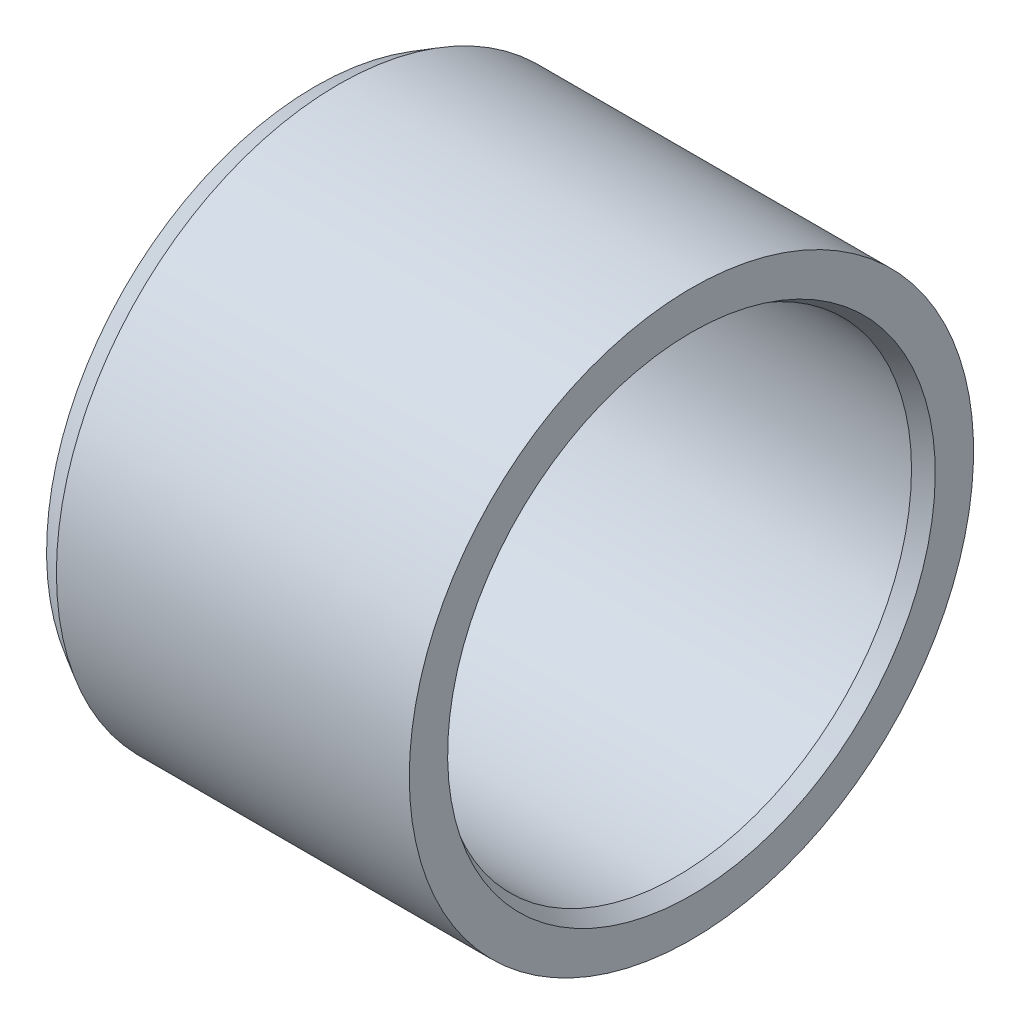
ISO-10303-21;
HEADER;
FILE_DESCRIPTION(('STEP AP214'),'2;1');
FILE_NAME('part.step','',(''),(''),'','','');
FILE_SCHEMA(('AUTOMOTIVE_DESIGN { 1 0 10303 214 1 1 1 1 }'));
ENDSEC;
DATA;
#1=APPLICATION_CONTEXT('core data for automotive mechanical design processes');
#2=APPLICATION_PROTOCOL_DEFINITION('international standard','automotive_design',2000,#1);
#3=PRODUCT_CONTEXT('',#1,'mechanical');
#4=PRODUCT('Part','Part','',(#3));
#5=PRODUCT_RELATED_PRODUCT_CATEGORY('part','',(#4));
#6=PRODUCT_DEFINITION_FORMATION('','',#4);
#7=PRODUCT_DEFINITION_CONTEXT('part definition',#1,'design');
#8=PRODUCT_DEFINITION('design','',#6,#7);
#9=PRODUCT_DEFINITION_SHAPE('','',#8);
#10=(LENGTH_UNIT() NAMED_UNIT(*) SI_UNIT(.MILLI.,.METRE.));
#11=(NAMED_UNIT(*) PLANE_ANGLE_UNIT() SI_UNIT($,.RADIAN.));
#12=(NAMED_UNIT(*) SI_UNIT($,.STERADIAN.) SOLID_ANGLE_UNIT());
#13=UNCERTAINTY_MEASURE_WITH_UNIT(LENGTH_MEASURE(1.E-05),#10,'distance_accuracy_value','');
#14=(GEOMETRIC_REPRESENTATION_CONTEXT(3) GLOBAL_UNCERTAINTY_ASSIGNED_CONTEXT((#13)) GLOBAL_UNIT_ASSIGNED_CONTEXT((#10,
#11,#12)) REPRESENTATION_CONTEXT('',''));
#15=CARTESIAN_POINT('',(0.,0.,0.));
#16=DIRECTION('',(0.,0.,1.));
#17=DIRECTION('',(1.,0.,0.));
#18=AXIS2_PLACEMENT_3D('',#15,#16,#17);
#19=CARTESIAN_POINT('',(12.7,0.,0.));
#20=DIRECTION('',(-1.,0.,0.));
#21=DIRECTION('',(0.,0.,1.));
#22=AXIS2_PLACEMENT_3D('',#19,#20,#21);
#23=CYLINDRICAL_SURFACE('',#22,7.9375);
#24=CARTESIAN_POINT('',(0.,0.,0.));
#25=DIRECTION('',(-1.,0.,0.));
#26=DIRECTION('',(0.,0.,1.));
#27=AXIS2_PLACEMENT_3D('',#24,#25,#26);
#28=CIRCLE('',#27,7.9375);
#29=CARTESIAN_POINT('',(0.,0.,7.93750000000001));
#30=VERTEX_POINT('',#29);
#31=EDGE_CURVE('E17',#30,#30,#28,.F.);
#32=ORIENTED_EDGE('',*,*,#31,.F.);
#33=EDGE_LOOP('',(#32));
#34=FACE_BOUND('',#33,.T.);
#35=CARTESIAN_POINT('',(12.192,0.,0.));
#36=DIRECTION('',(1.,0.,0.));
#37=DIRECTION('',(0.,0.,-1.));
#38=AXIS2_PLACEMENT_3D('',#35,#36,#37);
#39=CIRCLE('',#38,7.9375);
#40=CARTESIAN_POINT('',(12.192,0.,-7.93750000000001));
#41=VERTEX_POINT('',#40);
#42=EDGE_CURVE('E35',#41,#41,#39,.T.);
#43=ORIENTED_EDGE('',*,*,#42,.T.);
#44=EDGE_LOOP('',(#43));
#45=FACE_BOUND('',#44,.T.);
#46=ADVANCED_FACE('F14',(#34,#45),#23,.F.);
#47=CARTESIAN_POINT('',(0.,9.07039439804018,0.));
#48=DIRECTION('',(-1.,0.,0.));
#49=DIRECTION('',(0.,0.,1.));
#50=AXIS2_PLACEMENT_3D('',#47,#48,#49);
#51=PLANE('',#50);
#52=CARTESIAN_POINT('',(0.,0.,0.));
#53=DIRECTION('',(1.,0.,0.));
#54=DIRECTION('',(0.,1.,0.));
#55=AXIS2_PLACEMENT_3D('',#52,#53,#54);
#56=CIRCLE('',#55,9.07039439804009);
#57=CARTESIAN_POINT('',(0.,9.0703943980401,0.));
#58=VERTEX_POINT('',#57);
#59=EDGE_CURVE('E33',#58,#58,#56,.T.);
#60=ORIENTED_EDGE('',*,*,#59,.F.);
#61=EDGE_LOOP('',(#60));
#62=FACE_BOUND('',#61,.T.);
#63=ORIENTED_EDGE('',*,*,#31,.T.);
#64=EDGE_LOOP('',(#63));
#65=FACE_BOUND('',#64,.T.);
#66=ADVANCED_FACE('F46',(#62,#65),#51,.T.);
#67=CARTESIAN_POINT('',(12.7,0.,0.));
#68=DIRECTION('',(1.,0.,0.));
#69=DIRECTION('',(0.,1.,0.));
#70=AXIS2_PLACEMENT_3D('',#67,#68,#69);
#71=CONICAL_SURFACE('',#70,8.23079393674833,0.523598775598297);
#72=ORIENTED_EDGE('',*,*,#42,.F.);
#73=EDGE_LOOP('',(#72));
#74=FACE_BOUND('',#73,.T.);
#75=CARTESIAN_POINT('',(12.7,0.,0.));
#76=DIRECTION('',(1.,0.,0.));
#77=DIRECTION('',(0.,1.,0.));
#78=AXIS2_PLACEMENT_3D('',#75,#76,#77);
#79=CIRCLE('',#78,8.23079393674833);
#80=CARTESIAN_POINT('',(12.7,8.23079393674834,0.));
#81=VERTEX_POINT('',#80);
#82=EDGE_CURVE('E26',#81,#81,#79,.F.);
#83=ORIENTED_EDGE('',*,*,#82,.F.);
#84=EDGE_LOOP('',(#83));
#85=FACE_BOUND('',#84,.T.);
#86=ADVANCED_FACE('F53',(#74,#85),#71,.F.);
#87=CARTESIAN_POINT('',(0.787399999999994,0.,0.));
#88=DIRECTION('',(1.,0.,0.));
#89=DIRECTION('',(0.,1.,0.));
#90=AXIS2_PLACEMENT_3D('',#87,#88,#89);
#91=CONICAL_SURFACE('',#90,9.525,0.523598775598298);
#92=CARTESIAN_POINT('',(0.787399999999994,0.,0.));
#93=DIRECTION('',(-1.,0.,0.));
#94=DIRECTION('',(0.,0.,1.));
#95=AXIS2_PLACEMENT_3D('',#92,#93,#94);
#96=CIRCLE('',#95,9.525);
#97=CARTESIAN_POINT('',(0.787399999999994,0.,9.52500000000001));
#98=VERTEX_POINT('',#97);
#99=EDGE_CURVE('E21',#98,#98,#96,.F.);
#100=ORIENTED_EDGE('',*,*,#99,.F.);
#101=EDGE_LOOP('',(#100));
#102=FACE_BOUND('',#101,.T.);
#103=ORIENTED_EDGE('',*,*,#59,.T.);
#104=EDGE_LOOP('',(#103));
#105=FACE_BOUND('',#104,.T.);
#106=ADVANCED_FACE('F62',(#102,#105),#91,.T.);
#107=CARTESIAN_POINT('',(12.7,8.23079393674839,0.));
#108=DIRECTION('',(1.,0.,0.));
#109=DIRECTION('',(0.,0.,-1.));
#110=AXIS2_PLACEMENT_3D('',#107,#108,#109);
#111=PLANE('',#110);
#112=ORIENTED_EDGE('',*,*,#82,.T.);
#113=EDGE_LOOP('',(#112));
#114=FACE_BOUND('',#113,.T.);
#115=CARTESIAN_POINT('',(12.7,0.,0.));
#116=DIRECTION('',(-1.,0.,0.));
#117=DIRECTION('',(0.,0.,1.));
#118=AXIS2_PLACEMENT_3D('',#115,#116,#117);
#119=CIRCLE('',#118,9.525);
#120=CARTESIAN_POINT('',(12.7,0.,9.52500000000001));
#121=VERTEX_POINT('',#120);
#122=EDGE_CURVE('E10',#121,#121,#119,.T.);
#123=ORIENTED_EDGE('',*,*,#122,.F.);
#124=EDGE_LOOP('',(#123));
#125=FACE_BOUND('',#124,.T.);
#126=ADVANCED_FACE('F57',(#114,#125),#111,.T.);
#127=CARTESIAN_POINT('',(12.7,0.,0.));
#128=DIRECTION('',(-1.,0.,0.));
#129=DIRECTION('',(0.,0.,1.));
#130=AXIS2_PLACEMENT_3D('',#127,#128,#129);
#131=CYLINDRICAL_SURFACE('',#130,9.525);
#132=ORIENTED_EDGE('',*,*,#122,.T.);
#133=EDGE_LOOP('',(#132));
#134=FACE_BOUND('',#133,.T.);
#135=ORIENTED_EDGE('',*,*,#99,.T.);
#136=EDGE_LOOP('',(#135));
#137=FACE_BOUND('',#136,.T.);
#138=ADVANCED_FACE('F55',(#134,#137),#131,.T.);
#139=CLOSED_SHELL('',(#46,#66,#86,#106,#126,#138));
#140=MANIFOLD_SOLID_BREP('B1',#139);
#141=ADVANCED_BREP_SHAPE_REPRESENTATION('',(#18,#140),#14);
#142=SHAPE_DEFINITION_REPRESENTATION(#9,#141);
ENDSEC;
END-ISO-10303-21;
